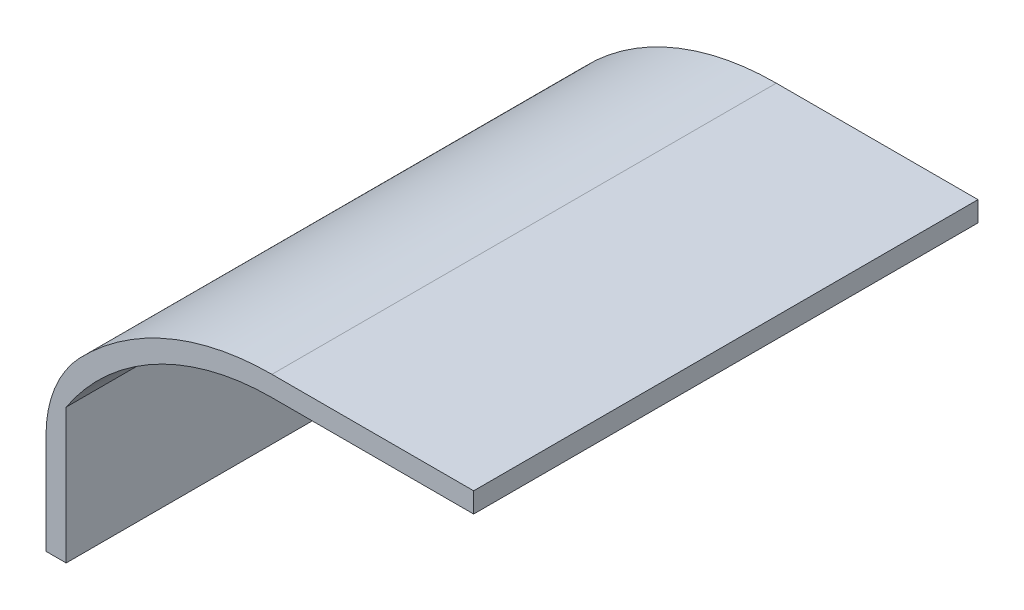
ISO-10303-21;
HEADER;
FILE_DESCRIPTION(('STEP AP214'),'2;1');
FILE_NAME('part.step','',(''),(''),'','','');
FILE_SCHEMA(('AUTOMOTIVE_DESIGN { 1 0 10303 214 1 1 1 1 }'));
ENDSEC;
DATA;
#1=APPLICATION_CONTEXT('core data for automotive mechanical design processes');
#2=APPLICATION_PROTOCOL_DEFINITION('international standard','automotive_design',2000,#1);
#3=PRODUCT_CONTEXT('',#1,'mechanical');
#4=PRODUCT('Part','Part','',(#3));
#5=PRODUCT_RELATED_PRODUCT_CATEGORY('part','',(#4));
#6=PRODUCT_DEFINITION_FORMATION('','',#4);
#7=PRODUCT_DEFINITION_CONTEXT('part definition',#1,'design');
#8=PRODUCT_DEFINITION('design','',#6,#7);
#9=PRODUCT_DEFINITION_SHAPE('','',#8);
#10=(LENGTH_UNIT() NAMED_UNIT(*) SI_UNIT(.MILLI.,.METRE.));
#11=(NAMED_UNIT(*) PLANE_ANGLE_UNIT() SI_UNIT($,.RADIAN.));
#12=(NAMED_UNIT(*) SI_UNIT($,.STERADIAN.) SOLID_ANGLE_UNIT());
#13=UNCERTAINTY_MEASURE_WITH_UNIT(LENGTH_MEASURE(1.E-05),#10,'distance_accuracy_value','');
#14=(GEOMETRIC_REPRESENTATION_CONTEXT(3) GLOBAL_UNCERTAINTY_ASSIGNED_CONTEXT((#13)) GLOBAL_UNIT_ASSIGNED_CONTEXT((#10,
#11,#12)) REPRESENTATION_CONTEXT('',''));
#15=CARTESIAN_POINT('',(0.,0.,0.));
#16=DIRECTION('',(0.,0.,1.));
#17=DIRECTION('',(1.,0.,0.));
#18=AXIS2_PLACEMENT_3D('',#15,#16,#17);
#19=CARTESIAN_POINT('',(0.,61.,125.));
#20=DIRECTION('',(-1.,0.,0.));
#21=DIRECTION('',(0.,0.,1.));
#22=AXIS2_PLACEMENT_3D('',#19,#20,#21);
#23=PLANE('',#22);
#24=DIRECTION('',(0.,1.,0.));
#25=VECTOR('',#24,1.);
#26=CARTESIAN_POINT('',(0.,61.,0.));
#27=LINE('',#26,#25);
#28=CARTESIAN_POINT('',(0.,61.,0.));
#29=VERTEX_POINT('',#28);
#30=CARTESIAN_POINT('',(0.,66.,0.));
#31=VERTEX_POINT('',#30);
#32=EDGE_CURVE('E126',#29,#31,#27,.T.);
#33=ORIENTED_EDGE('',*,*,#32,.T.);
#34=DIRECTION('',(0.,0.,-1.));
#35=VECTOR('',#34,1.);
#36=CARTESIAN_POINT('',(0.,66.,125.));
#37=LINE('',#36,#35);
#38=CARTESIAN_POINT('',(0.,66.,125.));
#39=VERTEX_POINT('',#38);
#40=EDGE_CURVE('E108',#39,#31,#37,.T.);
#41=ORIENTED_EDGE('',*,*,#40,.F.);
#42=DIRECTION('',(0.,1.,0.));
#43=VECTOR('',#42,1.);
#44=CARTESIAN_POINT('',(0.,61.,125.));
#45=LINE('',#44,#43);
#46=CARTESIAN_POINT('',(0.,61.,125.));
#47=VERTEX_POINT('',#46);
#48=EDGE_CURVE('E114',#47,#39,#45,.T.);
#49=ORIENTED_EDGE('',*,*,#48,.F.);
#50=DIRECTION('',(0.,0.,-1.));
#51=VECTOR('',#50,1.);
#52=CARTESIAN_POINT('',(0.,61.,125.));
#53=LINE('',#52,#51);
#54=EDGE_CURVE('E146',#47,#29,#53,.T.);
#55=ORIENTED_EDGE('',*,*,#54,.T.);
#56=EDGE_LOOP('',(#33,#41,#49,#55));
#57=FACE_BOUND('',#56,.T.);
#58=ADVANCED_FACE('F33',(#57),#23,.F.);
#59=CARTESIAN_POINT('',(-50.0000000000001,66.,125.));
#60=DIRECTION('',(0.,-1.,0.));
#61=DIRECTION('',(0.,0.,-1.));
#62=AXIS2_PLACEMENT_3D('',#59,#60,#61);
#63=PLANE('',#62);
#64=DIRECTION('',(-1.,0.,0.));
#65=VECTOR('',#64,1.);
#66=CARTESIAN_POINT('',(-50.0000000000001,66.,0.));
#67=LINE('',#66,#65);
#68=CARTESIAN_POINT('',(-50.0000000000001,66.,0.));
#69=VERTEX_POINT('',#68);
#70=EDGE_CURVE('E159',#31,#69,#67,.T.);
#71=ORIENTED_EDGE('',*,*,#70,.T.);
#72=DIRECTION('',(0.,0.,-1.));
#73=VECTOR('',#72,1.);
#74=CARTESIAN_POINT('',(-50.0000000000001,66.,125.));
#75=LINE('',#74,#73);
#76=CARTESIAN_POINT('',(-50.0000000000001,66.,125.));
#77=VERTEX_POINT('',#76);
#78=EDGE_CURVE('E111',#77,#69,#75,.T.);
#79=ORIENTED_EDGE('',*,*,#78,.F.);
#80=DIRECTION('',(-1.,0.,0.));
#81=VECTOR('',#80,1.);
#82=CARTESIAN_POINT('',(-50.0000000000001,66.,125.));
#83=LINE('',#82,#81);
#84=EDGE_CURVE('E104',#39,#77,#83,.T.);
#85=ORIENTED_EDGE('',*,*,#84,.F.);
#86=ORIENTED_EDGE('',*,*,#40,.T.);
#87=EDGE_LOOP('',(#71,#79,#85,#86));
#88=FACE_BOUND('',#87,.T.);
#89=ADVANCED_FACE('F106',(#88),#63,.F.);
#90=CARTESIAN_POINT('',(-49.9999999999989,-2.019218126037E-12,125.));
#91=DIRECTION('',(0.,0.,-1.));
#92=DIRECTION('',(-1.,0.,0.));
#93=AXIS2_PLACEMENT_3D('',#90,#91,#92);
#94=CYLINDRICAL_SURFACE('',#93,66.000000000002);
#95=CARTESIAN_POINT('',(-49.9999999999989,-2.019218126037E-12,0.));
#96=DIRECTION('',(0.,0.,1.));
#97=DIRECTION('',(-1.,0.,0.));
#98=AXIS2_PLACEMENT_3D('',#95,#96,#97);
#99=CIRCLE('',#98,66.000000000002);
#100=CARTESIAN_POINT('',(-97.6666666666664,45.6496318592921,0.));
#101=VERTEX_POINT('',#100);
#102=EDGE_CURVE('E157',#69,#101,#99,.T.);
#103=ORIENTED_EDGE('',*,*,#102,.T.);
#104=DIRECTION('',(0.,0.,-1.));
#105=VECTOR('',#104,1.);
#106=CARTESIAN_POINT('',(-97.6666666666664,45.6496318592921,125.));
#107=LINE('',#106,#105);
#108=CARTESIAN_POINT('',(-97.6666666666664,45.6496318592921,125.));
#109=VERTEX_POINT('',#108);
#110=EDGE_CURVE('E41',#101,#109,#107,.F.);
#111=ORIENTED_EDGE('',*,*,#110,.T.);
#112=CARTESIAN_POINT('',(-49.9999999999989,-2.019218126037E-12,125.));
#113=DIRECTION('',(0.,0.,1.));
#114=DIRECTION('',(-1.,0.,0.));
#115=AXIS2_PLACEMENT_3D('',#112,#113,#114);
#116=CIRCLE('',#115,66.000000000002);
#117=EDGE_CURVE('E113',#77,#109,#116,.T.);
#118=ORIENTED_EDGE('',*,*,#117,.F.);
#119=ORIENTED_EDGE('',*,*,#78,.T.);
#120=EDGE_LOOP('',(#103,#111,#118,#119));
#121=FACE_BOUND('',#120,.T.);
#122=ADVANCED_FACE('F197',(#121),#94,.T.);
#123=CARTESIAN_POINT('',(-106.,0.,125.));
#124=DIRECTION('',(1.,0.,0.));
#125=DIRECTION('',(0.,0.,-1.));
#126=AXIS2_PLACEMENT_3D('',#123,#124,#125);
#127=PLANE('',#126);
#128=DIRECTION('',(0.,-1.,0.));
#129=VECTOR('',#128,1.);
#130=CARTESIAN_POINT('',(-106.,0.,125.));
#131=LINE('',#130,#129);
#132=CARTESIAN_POINT('',(-106.,24.8997991959772,125.));
#133=VERTEX_POINT('',#132);
#134=CARTESIAN_POINT('',(-106.,0.,125.));
#135=VERTEX_POINT('',#134);
#136=EDGE_CURVE('E169',#133,#135,#131,.T.);
#137=ORIENTED_EDGE('',*,*,#136,.F.);
#138=DIRECTION('',(0.,0.,-1.));
#139=VECTOR('',#138,1.);
#140=CARTESIAN_POINT('',(-106.,24.8997991959772,125.));
#141=LINE('',#140,#139);
#142=CARTESIAN_POINT('',(-106.,24.8997991959772,0.));
#143=VERTEX_POINT('',#142);
#144=EDGE_CURVE('E127',#133,#143,#141,.T.);
#145=ORIENTED_EDGE('',*,*,#144,.T.);
#146=DIRECTION('',(0.,-1.,0.));
#147=VECTOR('',#146,1.);
#148=CARTESIAN_POINT('',(-106.,0.,0.));
#149=LINE('',#148,#147);
#150=CARTESIAN_POINT('',(-106.,0.,0.));
#151=VERTEX_POINT('',#150);
#152=EDGE_CURVE('E155',#143,#151,#149,.T.);
#153=ORIENTED_EDGE('',*,*,#152,.T.);
#154=DIRECTION('',(0.,0.,-1.));
#155=VECTOR('',#154,1.);
#156=CARTESIAN_POINT('',(-106.,0.,125.));
#157=LINE('',#156,#155);
#158=EDGE_CURVE('E131',#135,#151,#157,.T.);
#159=ORIENTED_EDGE('',*,*,#158,.F.);
#160=EDGE_LOOP('',(#137,#145,#153,#159));
#161=FACE_BOUND('',#160,.T.);
#162=ADVANCED_FACE('F176',(#161),#127,.F.);
#163=CARTESIAN_POINT('',(-101.,0.,125.));
#164=DIRECTION('',(0.,1.,0.));
#165=DIRECTION('',(0.,0.,1.));
#166=AXIS2_PLACEMENT_3D('',#163,#164,#165);
#167=PLANE('',#166);
#168=DIRECTION('',(1.,0.,0.));
#169=VECTOR('',#168,1.);
#170=CARTESIAN_POINT('',(-101.,0.,0.));
#171=LINE('',#170,#169);
#172=CARTESIAN_POINT('',(-101.,0.,0.));
#173=VERTEX_POINT('',#172);
#174=EDGE_CURVE('E153',#151,#173,#171,.T.);
#175=ORIENTED_EDGE('',*,*,#174,.T.);
#176=DIRECTION('',(0.,0.,-1.));
#177=VECTOR('',#176,1.);
#178=CARTESIAN_POINT('',(-101.,0.,125.));
#179=LINE('',#178,#177);
#180=CARTESIAN_POINT('',(-101.,0.,125.));
#181=VERTEX_POINT('',#180);
#182=EDGE_CURVE('E137',#181,#173,#179,.T.);
#183=ORIENTED_EDGE('',*,*,#182,.F.);
#184=DIRECTION('',(1.,0.,0.));
#185=VECTOR('',#184,1.);
#186=CARTESIAN_POINT('',(-101.,0.,125.));
#187=LINE('',#186,#185);
#188=EDGE_CURVE('E167',#135,#181,#187,.T.);
#189=ORIENTED_EDGE('',*,*,#188,.F.);
#190=ORIENTED_EDGE('',*,*,#158,.T.);
#191=EDGE_LOOP('',(#175,#183,#189,#190));
#192=FACE_BOUND('',#191,.T.);
#193=ADVANCED_FACE('F184',(#192),#167,.F.);
#194=CARTESIAN_POINT('',(-101.,0.,125.));
#195=DIRECTION('',(-1.,0.,0.));
#196=DIRECTION('',(0.,0.,1.));
#197=AXIS2_PLACEMENT_3D('',#194,#195,#196);
#198=PLANE('',#197);
#199=DIRECTION('',(0.,1.,0.));
#200=VECTOR('',#199,1.);
#201=CARTESIAN_POINT('',(-101.,0.,0.));
#202=LINE('',#201,#200);
#203=CARTESIAN_POINT('',(-101.,33.466401061363,0.));
#204=VERTEX_POINT('',#203);
#205=EDGE_CURVE('E151',#173,#204,#202,.T.);
#206=ORIENTED_EDGE('',*,*,#205,.T.);
#207=DIRECTION('',(0.,0.,-1.));
#208=VECTOR('',#207,1.);
#209=CARTESIAN_POINT('',(-101.,33.466401061363,125.));
#210=LINE('',#209,#208);
#211=CARTESIAN_POINT('',(-101.,33.466401061363,125.));
#212=VERTEX_POINT('',#211);
#213=EDGE_CURVE('E140',#212,#204,#210,.T.);
#214=ORIENTED_EDGE('',*,*,#213,.F.);
#215=DIRECTION('',(0.,1.,0.));
#216=VECTOR('',#215,1.);
#217=CARTESIAN_POINT('',(-101.,0.,125.));
#218=LINE('',#217,#216);
#219=EDGE_CURVE('E165',#181,#212,#218,.T.);
#220=ORIENTED_EDGE('',*,*,#219,.F.);
#221=ORIENTED_EDGE('',*,*,#182,.T.);
#222=EDGE_LOOP('',(#206,#214,#220,#221));
#223=FACE_BOUND('',#222,.T.);
#224=ADVANCED_FACE('F188',(#223),#198,.F.);
#225=CARTESIAN_POINT('',(-49.9999999999989,-2.019218126037E-12,125.));
#226=DIRECTION('',(0.,0.,-1.));
#227=DIRECTION('',(-1.,0.,0.));
#228=AXIS2_PLACEMENT_3D('',#225,#226,#227);
#229=CYLINDRICAL_SURFACE('',#228,61.000000000002);
#230=CARTESIAN_POINT('',(-49.9999999999989,-2.019218126037E-12,0.));
#231=DIRECTION('',(0.,0.,-1.));
#232=DIRECTION('',(-1.,0.,0.));
#233=AXIS2_PLACEMENT_3D('',#230,#231,#232);
#234=CIRCLE('',#233,61.000000000002);
#235=CARTESIAN_POINT('',(-50.,61.,0.));
#236=VERTEX_POINT('',#235);
#237=EDGE_CURVE('E149',#204,#236,#234,.T.);
#238=ORIENTED_EDGE('',*,*,#237,.T.);
#239=DIRECTION('',(0.,0.,-1.));
#240=VECTOR('',#239,1.);
#241=CARTESIAN_POINT('',(-50.,61.,125.));
#242=LINE('',#241,#240);
#243=CARTESIAN_POINT('',(-50.,61.,125.));
#244=VERTEX_POINT('',#243);
#245=EDGE_CURVE('E143',#244,#236,#242,.T.);
#246=ORIENTED_EDGE('',*,*,#245,.F.);
#247=CARTESIAN_POINT('',(-49.9999999999989,-2.019218126037E-12,125.));
#248=DIRECTION('',(0.,0.,-1.));
#249=DIRECTION('',(-1.,0.,0.));
#250=AXIS2_PLACEMENT_3D('',#247,#248,#249);
#251=CIRCLE('',#250,61.000000000002);
#252=EDGE_CURVE('E163',#212,#244,#251,.T.);
#253=ORIENTED_EDGE('',*,*,#252,.F.);
#254=ORIENTED_EDGE('',*,*,#213,.T.);
#255=EDGE_LOOP('',(#238,#246,#253,#254));
#256=FACE_BOUND('',#255,.T.);
#257=ADVANCED_FACE('F193',(#256),#229,.F.);
#258=CARTESIAN_POINT('',(-50.,61.,125.));
#259=DIRECTION('',(0.,1.,0.));
#260=DIRECTION('',(-1.,0.,0.));
#261=AXIS2_PLACEMENT_3D('',#258,#259,#260);
#262=PLANE('',#261);
#263=DIRECTION('',(1.,0.,0.));
#264=VECTOR('',#263,1.);
#265=CARTESIAN_POINT('',(-50.,61.,0.));
#266=LINE('',#265,#264);
#267=EDGE_CURVE('E123',#236,#29,#266,.T.);
#268=ORIENTED_EDGE('',*,*,#267,.T.);
#269=ORIENTED_EDGE('',*,*,#54,.F.);
#270=DIRECTION('',(1.,0.,0.));
#271=VECTOR('',#270,1.);
#272=CARTESIAN_POINT('',(-50.,61.,125.));
#273=LINE('',#272,#271);
#274=EDGE_CURVE('E119',#244,#47,#273,.T.);
#275=ORIENTED_EDGE('',*,*,#274,.F.);
#276=ORIENTED_EDGE('',*,*,#245,.T.);
#277=EDGE_LOOP('',(#268,#269,#275,#276));
#278=FACE_BOUND('',#277,.T.);
#279=ADVANCED_FACE('F196',(#278),#262,.F.);
#280=CARTESIAN_POINT('',(-49.9999999999989,-2.019218126037E-12,125.));
#281=DIRECTION('',(0.,0.,-1.));
#282=DIRECTION('',(-1.,0.,0.));
#283=AXIS2_PLACEMENT_3D('',#280,#281,#282);
#284=PLANE('',#283);
#285=ORIENTED_EDGE('',*,*,#117,.T.);
#286=CARTESIAN_POINT('',(-76.,24.8997991959772,125.));
#287=DIRECTION('',(0.,0.,-1.));
#288=DIRECTION('',(-1.,0.,0.));
#289=AXIS2_PLACEMENT_3D('',#286,#287,#288);
#290=CIRCLE('',#289,30.);
#291=EDGE_CURVE('E11',#109,#133,#290,.F.);
#292=ORIENTED_EDGE('',*,*,#291,.T.);
#293=ORIENTED_EDGE('',*,*,#136,.T.);
#294=ORIENTED_EDGE('',*,*,#188,.T.);
#295=ORIENTED_EDGE('',*,*,#219,.T.);
#296=ORIENTED_EDGE('',*,*,#252,.T.);
#297=ORIENTED_EDGE('',*,*,#274,.T.);
#298=ORIENTED_EDGE('',*,*,#48,.T.);
#299=ORIENTED_EDGE('',*,*,#84,.T.);
#300=EDGE_LOOP('',(#285,#292,#293,#294,#295,#296,#297,#298,#299));
#301=FACE_BOUND('',#300,.T.);
#302=ADVANCED_FACE('F117',(#301),#284,.F.);
#303=CARTESIAN_POINT('',(-49.9999999999989,-2.019218126037E-12,0.));
#304=DIRECTION('',(0.,0.,-1.));
#305=DIRECTION('',(-1.,0.,0.));
#306=AXIS2_PLACEMENT_3D('',#303,#304,#305);
#307=PLANE('',#306);
#308=ORIENTED_EDGE('',*,*,#152,.F.);
#309=CARTESIAN_POINT('',(-76.,24.8997991959772,0.));
#310=DIRECTION('',(0.,0.,-1.));
#311=DIRECTION('',(-1.,0.,0.));
#312=AXIS2_PLACEMENT_3D('',#309,#310,#311);
#313=CIRCLE('',#312,30.);
#314=EDGE_CURVE('E55',#143,#101,#313,.T.);
#315=ORIENTED_EDGE('',*,*,#314,.T.);
#316=ORIENTED_EDGE('',*,*,#102,.F.);
#317=ORIENTED_EDGE('',*,*,#70,.F.);
#318=ORIENTED_EDGE('',*,*,#32,.F.);
#319=ORIENTED_EDGE('',*,*,#267,.F.);
#320=ORIENTED_EDGE('',*,*,#237,.F.);
#321=ORIENTED_EDGE('',*,*,#205,.F.);
#322=ORIENTED_EDGE('',*,*,#174,.F.);
#323=EDGE_LOOP('',(#308,#315,#316,#317,#318,#319,#320,#321,#322));
#324=FACE_BOUND('',#323,.T.);
#325=ADVANCED_FACE('F179',(#324),#307,.T.);
#326=CARTESIAN_POINT('',(-76.,24.8997991959772,125.));
#327=DIRECTION('',(0.,0.,-1.));
#328=DIRECTION('',(-1.,0.,0.));
#329=AXIS2_PLACEMENT_3D('',#326,#327,#328);
#330=CYLINDRICAL_SURFACE('',#329,30.);
#331=ORIENTED_EDGE('',*,*,#291,.F.);
#332=ORIENTED_EDGE('',*,*,#110,.F.);
#333=ORIENTED_EDGE('',*,*,#314,.F.);
#334=ORIENTED_EDGE('',*,*,#144,.F.);
#335=EDGE_LOOP('',(#331,#332,#333,#334));
#336=FACE_BOUND('',#335,.T.);
#337=ADVANCED_FACE('F35',(#336),#330,.T.);
#338=CLOSED_SHELL('',(#58,#89,#122,#162,#193,#224,#257,#279,#302,#325,#337));
#339=MANIFOLD_SOLID_BREP('B2',#338);
#340=ADVANCED_BREP_SHAPE_REPRESENTATION('',(#18,#339),#14);
#341=SHAPE_DEFINITION_REPRESENTATION(#9,#340);
ENDSEC;
END-ISO-10303-21;
